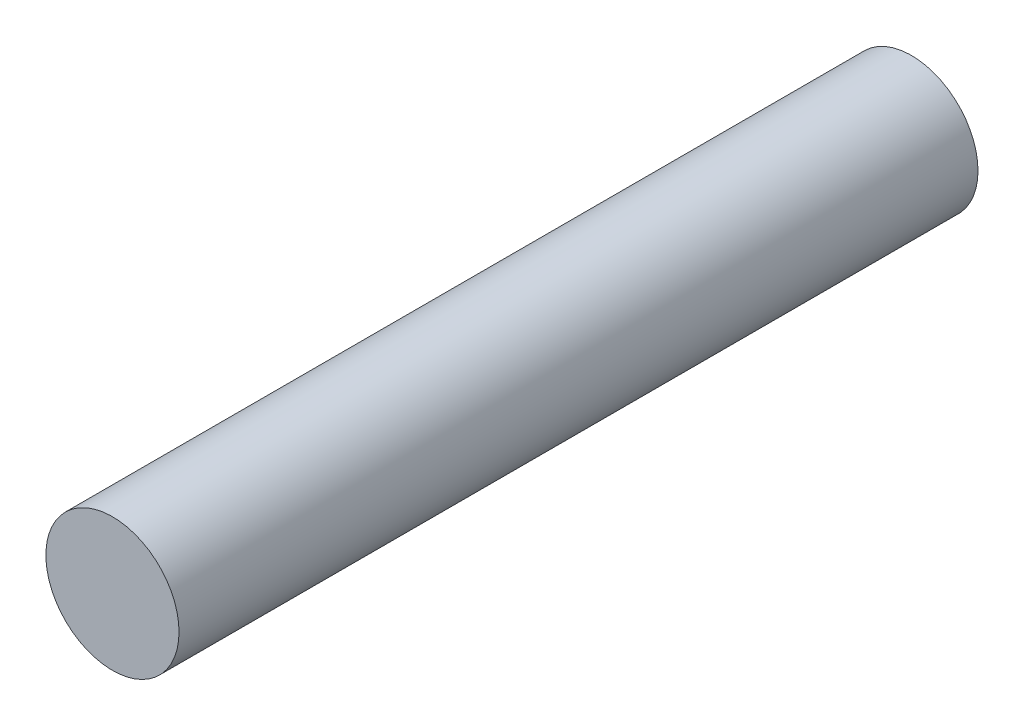
ISO-10303-21;
HEADER;
FILE_DESCRIPTION(('STEP AP214'),'2;1');
FILE_NAME('part.step','',(''),(''),'','','');
FILE_SCHEMA(('AUTOMOTIVE_DESIGN { 1 0 10303 214 1 1 1 1 }'));
ENDSEC;
DATA;
#1=APPLICATION_CONTEXT('core data for automotive mechanical design processes');
#2=APPLICATION_PROTOCOL_DEFINITION('international standard','automotive_design',2000,#1);
#3=PRODUCT_CONTEXT('',#1,'mechanical');
#4=PRODUCT('Part','Part','',(#3));
#5=PRODUCT_RELATED_PRODUCT_CATEGORY('part','',(#4));
#6=PRODUCT_DEFINITION_FORMATION('','',#4);
#7=PRODUCT_DEFINITION_CONTEXT('part definition',#1,'design');
#8=PRODUCT_DEFINITION('design','',#6,#7);
#9=PRODUCT_DEFINITION_SHAPE('','',#8);
#10=(LENGTH_UNIT() NAMED_UNIT(*) SI_UNIT(.MILLI.,.METRE.));
#11=(NAMED_UNIT(*) PLANE_ANGLE_UNIT() SI_UNIT($,.RADIAN.));
#12=(NAMED_UNIT(*) SI_UNIT($,.STERADIAN.) SOLID_ANGLE_UNIT());
#13=UNCERTAINTY_MEASURE_WITH_UNIT(LENGTH_MEASURE(1.E-05),#10,'distance_accuracy_value','');
#14=(GEOMETRIC_REPRESENTATION_CONTEXT(3) GLOBAL_UNCERTAINTY_ASSIGNED_CONTEXT((#13)) GLOBAL_UNIT_ASSIGNED_CONTEXT((#10,
#11,#12)) REPRESENTATION_CONTEXT('',''));
#15=CARTESIAN_POINT('',(0.,0.,0.));
#16=DIRECTION('',(0.,0.,1.));
#17=DIRECTION('',(1.,0.,0.));
#18=AXIS2_PLACEMENT_3D('',#15,#16,#17);
#19=CARTESIAN_POINT('',(0.,0.,22.5));
#20=DIRECTION('',(0.,0.,-1.));
#21=DIRECTION('',(-1.,0.,0.));
#22=AXIS2_PLACEMENT_3D('',#19,#20,#21);
#23=CYLINDRICAL_SURFACE('',#22,1.875);
#24=CARTESIAN_POINT('',(0.,0.,22.5));
#25=DIRECTION('',(0.,0.,1.));
#26=DIRECTION('',(1.,0.,0.));
#27=AXIS2_PLACEMENT_3D('',#24,#25,#26);
#28=CIRCLE('',#27,1.875);
#29=CARTESIAN_POINT('',(1.875,0.,22.5));
#30=VERTEX_POINT('',#29);
#31=EDGE_CURVE('E10',#30,#30,#28,.T.);
#32=ORIENTED_EDGE('',*,*,#31,.F.);
#33=EDGE_LOOP('',(#32));
#34=FACE_BOUND('',#33,.T.);
#35=CARTESIAN_POINT('',(0.,0.,0.));
#36=DIRECTION('',(0.,0.,1.));
#37=DIRECTION('',(1.,0.,0.));
#38=AXIS2_PLACEMENT_3D('',#35,#36,#37);
#39=CIRCLE('',#38,1.875);
#40=CARTESIAN_POINT('',(1.875,0.,0.));
#41=VERTEX_POINT('',#40);
#42=EDGE_CURVE('E40',#41,#41,#39,.T.);
#43=ORIENTED_EDGE('',*,*,#42,.T.);
#44=EDGE_LOOP('',(#43));
#45=FACE_BOUND('',#44,.T.);
#46=ADVANCED_FACE('F37',(#34,#45),#23,.T.);
#47=CARTESIAN_POINT('',(0.,0.,22.5));
#48=DIRECTION('',(0.,0.,1.));
#49=DIRECTION('',(1.,0.,0.));
#50=AXIS2_PLACEMENT_3D('',#47,#48,#49);
#51=PLANE('',#50);
#52=ORIENTED_EDGE('',*,*,#31,.T.);
#53=EDGE_LOOP('',(#52));
#54=FACE_BOUND('',#53,.T.);
#55=ADVANCED_FACE('F54',(#54),#51,.T.);
#56=CARTESIAN_POINT('',(0.,0.,0.));
#57=DIRECTION('',(0.,0.,1.));
#58=DIRECTION('',(1.,0.,0.));
#59=AXIS2_PLACEMENT_3D('',#56,#57,#58);
#60=PLANE('',#59);
#61=ORIENTED_EDGE('',*,*,#42,.F.);
#62=EDGE_LOOP('',(#61));
#63=FACE_BOUND('',#62,.T.);
#64=ADVANCED_FACE('F52',(#63),#60,.F.);
#65=CLOSED_SHELL('',(#46,#55,#64));
#66=MANIFOLD_SOLID_BREP('B2',#65);
#67=ADVANCED_BREP_SHAPE_REPRESENTATION('',(#18,#66),#14);
#68=SHAPE_DEFINITION_REPRESENTATION(#9,#67);
ENDSEC;
END-ISO-10303-21;
